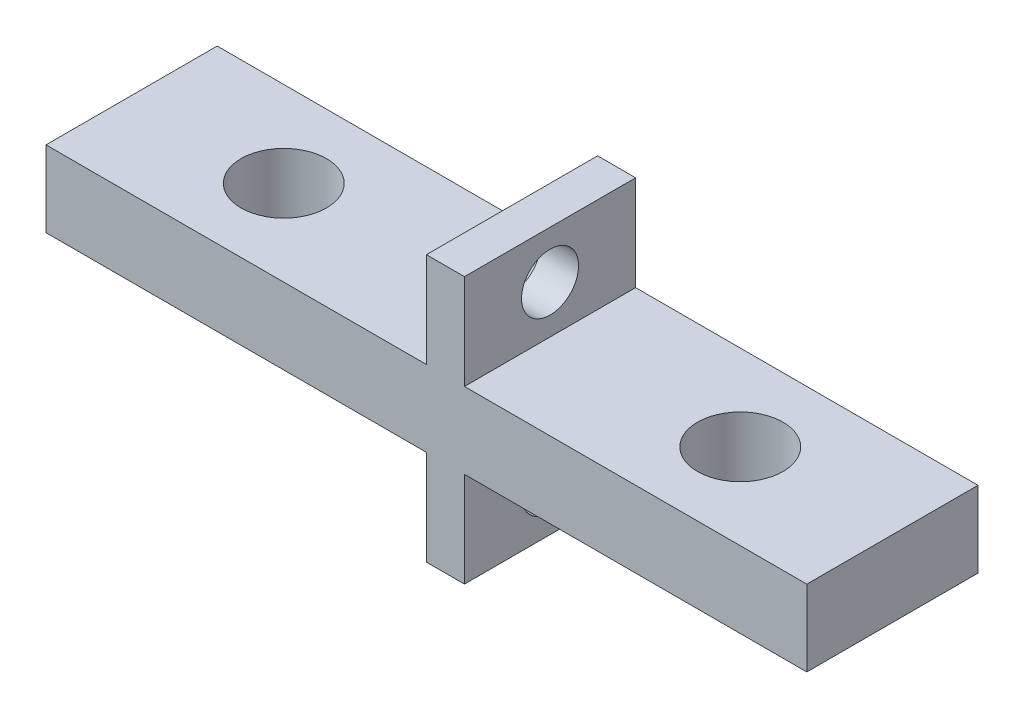
ISO-10303-21;
HEADER;
FILE_DESCRIPTION(('STEP AP214'),'2;1');
FILE_NAME('part.step','',(''),(''),'','','');
FILE_SCHEMA(('AUTOMOTIVE_DESIGN { 1 0 10303 214 1 1 1 1 }'));
ENDSEC;
DATA;
#1=APPLICATION_CONTEXT('core data for automotive mechanical design processes');
#2=APPLICATION_PROTOCOL_DEFINITION('international standard','automotive_design',2000,#1);
#3=PRODUCT_CONTEXT('',#1,'mechanical');
#4=PRODUCT('Part','Part','',(#3));
#5=PRODUCT_RELATED_PRODUCT_CATEGORY('part','',(#4));
#6=PRODUCT_DEFINITION_FORMATION('','',#4);
#7=PRODUCT_DEFINITION_CONTEXT('part definition',#1,'design');
#8=PRODUCT_DEFINITION('design','',#6,#7);
#9=PRODUCT_DEFINITION_SHAPE('','',#8);
#10=(LENGTH_UNIT() NAMED_UNIT(*) SI_UNIT(.MILLI.,.METRE.));
#11=(NAMED_UNIT(*) PLANE_ANGLE_UNIT() SI_UNIT($,.RADIAN.));
#12=(NAMED_UNIT(*) SI_UNIT($,.STERADIAN.) SOLID_ANGLE_UNIT());
#13=UNCERTAINTY_MEASURE_WITH_UNIT(LENGTH_MEASURE(1.E-05),#10,'distance_accuracy_value','');
#14=(GEOMETRIC_REPRESENTATION_CONTEXT(3) GLOBAL_UNCERTAINTY_ASSIGNED_CONTEXT((#13)) GLOBAL_UNIT_ASSIGNED_CONTEXT((#10,
#11,#12)) REPRESENTATION_CONTEXT('',''));
#15=CARTESIAN_POINT('',(0.,0.,0.));
#16=DIRECTION('',(0.,0.,1.));
#17=DIRECTION('',(1.,0.,0.));
#18=AXIS2_PLACEMENT_3D('',#15,#16,#17);
#19=CARTESIAN_POINT('',(0.,4.,0.));
#20=DIRECTION('',(0.,1.,0.));
#21=DIRECTION('',(0.,0.,1.));
#22=AXIS2_PLACEMENT_3D('',#19,#20,#21);
#23=PLANE('',#22);
#24=DIRECTION('',(0.,0.,1.));
#25=VECTOR('',#24,1.);
#26=CARTESIAN_POINT('',(12.7736329978232,4.,0.));
#27=LINE('',#26,#25);
#28=CARTESIAN_POINT('',(12.7736329978232,4.,-5.3135593220339));
#29=VERTEX_POINT('',#28);
#30=CARTESIAN_POINT('',(12.7736329978232,4.,3.6864406779661));
#31=VERTEX_POINT('',#30);
#32=EDGE_CURVE('E47',#29,#31,#27,.T.);
#33=ORIENTED_EDGE('',*,*,#32,.F.);
#34=DIRECTION('',(-1.,0.,0.));
#35=VECTOR('',#34,1.);
#36=CARTESIAN_POINT('',(-7.22636700217678,4.,-5.3135593220339));
#37=LINE('',#36,#35);
#38=CARTESIAN_POINT('',(-7.22636700217678,4.,-5.3135593220339));
#39=VERTEX_POINT('',#38);
#40=EDGE_CURVE('E200',#29,#39,#37,.T.);
#41=ORIENTED_EDGE('',*,*,#40,.T.);
#42=DIRECTION('',(0.,0.,1.));
#43=VECTOR('',#42,1.);
#44=CARTESIAN_POINT('',(-7.22636700217678,4.,-5.3135593220339));
#45=LINE('',#44,#43);
#46=CARTESIAN_POINT('',(-7.22636700217678,4.,3.6864406779661));
#47=VERTEX_POINT('',#46);
#48=EDGE_CURVE('E191',#39,#47,#45,.T.);
#49=ORIENTED_EDGE('',*,*,#48,.T.);
#50=DIRECTION('',(1.,0.,0.));
#51=VECTOR('',#50,1.);
#52=CARTESIAN_POINT('',(-7.22636700217678,4.,3.6864406779661));
#53=LINE('',#52,#51);
#54=EDGE_CURVE('E196',#47,#31,#53,.T.);
#55=ORIENTED_EDGE('',*,*,#54,.T.);
#56=EDGE_LOOP('',(#33,#41,#49,#55));
#57=FACE_BOUND('',#56,.T.);
#58=CARTESIAN_POINT('',(0.773632997823222,4.,-0.8135593220339));
#59=DIRECTION('',(0.,1.,0.));
#60=DIRECTION('',(0.,0.,1.));
#61=AXIS2_PLACEMENT_3D('',#58,#59,#60);
#62=CIRCLE('',#61,2.2479);
#63=CARTESIAN_POINT('',(0.773632997823222,4.,1.4343406779661));
#64=VERTEX_POINT('',#63);
#65=EDGE_CURVE('E180',#64,#64,#62,.T.);
#66=ORIENTED_EDGE('',*,*,#65,.F.);
#67=EDGE_LOOP('',(#66));
#68=FACE_BOUND('',#67,.T.);
#69=ADVANCED_FACE('F32',(#57,#68),#23,.T.);
#70=CARTESIAN_POINT('',(0.,0.,0.));
#71=DIRECTION('',(0.,1.,0.));
#72=DIRECTION('',(0.,0.,1.));
#73=AXIS2_PLACEMENT_3D('',#70,#71,#72);
#74=PLANE('',#73);
#75=CARTESIAN_POINT('',(0.773632997823222,0.,-0.8135593220339));
#76=DIRECTION('',(0.,1.,0.));
#77=DIRECTION('',(0.,0.,1.));
#78=AXIS2_PLACEMENT_3D('',#75,#76,#77);
#79=CIRCLE('',#78,2.2479);
#80=CARTESIAN_POINT('',(0.773632997823222,0.,1.4343406779661));
#81=VERTEX_POINT('',#80);
#82=EDGE_CURVE('E183',#81,#81,#79,.T.);
#83=ORIENTED_EDGE('',*,*,#82,.T.);
#84=EDGE_LOOP('',(#83));
#85=FACE_BOUND('',#84,.T.);
#86=DIRECTION('',(-1.,0.,0.));
#87=VECTOR('',#86,1.);
#88=CARTESIAN_POINT('',(-7.22636700217678,0.,-5.3135593220339));
#89=LINE('',#88,#87);
#90=CARTESIAN_POINT('',(12.7736329978232,0.,-5.3135593220339));
#91=VERTEX_POINT('',#90);
#92=CARTESIAN_POINT('',(-7.22636700217678,0.,-5.3135593220339));
#93=VERTEX_POINT('',#92);
#94=EDGE_CURVE('E211',#91,#93,#89,.T.);
#95=ORIENTED_EDGE('',*,*,#94,.F.);
#96=DIRECTION('',(0.,0.,1.));
#97=VECTOR('',#96,1.);
#98=CARTESIAN_POINT('',(12.7736329978232,0.,0.));
#99=LINE('',#98,#97);
#100=CARTESIAN_POINT('',(12.7736329978232,0.,3.6864406779661));
#101=VERTEX_POINT('',#100);
#102=EDGE_CURVE('E11',#91,#101,#99,.T.);
#103=ORIENTED_EDGE('',*,*,#102,.T.);
#104=DIRECTION('',(1.,0.,0.));
#105=VECTOR('',#104,1.);
#106=CARTESIAN_POINT('',(-7.22636700217678,0.,3.6864406779661));
#107=LINE('',#106,#105);
#108=CARTESIAN_POINT('',(-7.22636700217678,0.,3.6864406779661));
#109=VERTEX_POINT('',#108);
#110=EDGE_CURVE('E206',#109,#101,#107,.T.);
#111=ORIENTED_EDGE('',*,*,#110,.F.);
#112=DIRECTION('',(0.,0.,1.));
#113=VECTOR('',#112,1.);
#114=CARTESIAN_POINT('',(-7.22636700217678,0.,-5.3135593220339));
#115=LINE('',#114,#113);
#116=EDGE_CURVE('E190',#93,#109,#115,.T.);
#117=ORIENTED_EDGE('',*,*,#116,.F.);
#118=EDGE_LOOP('',(#95,#103,#111,#117));
#119=FACE_BOUND('',#118,.T.);
#120=ADVANCED_FACE('F254',(#85,#119),#74,.F.);
#121=CARTESIAN_POINT('',(-7.22636700217678,4.,-5.3135593220339));
#122=DIRECTION('',(1.,0.,0.));
#123=DIRECTION('',(0.,0.,-1.));
#124=AXIS2_PLACEMENT_3D('',#121,#122,#123);
#125=PLANE('',#124);
#126=ORIENTED_EDGE('',*,*,#116,.T.);
#127=DIRECTION('',(0.,-1.,0.));
#128=VECTOR('',#127,1.);
#129=CARTESIAN_POINT('',(-7.22636700217678,4.,3.6864406779661));
#130=LINE('',#129,#128);
#131=EDGE_CURVE('E222',#47,#109,#130,.T.);
#132=ORIENTED_EDGE('',*,*,#131,.F.);
#133=ORIENTED_EDGE('',*,*,#48,.F.);
#134=DIRECTION('',(0.,-1.,0.));
#135=VECTOR('',#134,1.);
#136=CARTESIAN_POINT('',(-7.22636700217678,4.,-5.3135593220339));
#137=LINE('',#136,#135);
#138=EDGE_CURVE('E202',#39,#93,#137,.T.);
#139=ORIENTED_EDGE('',*,*,#138,.T.);
#140=EDGE_LOOP('',(#126,#132,#133,#139));
#141=FACE_BOUND('',#140,.T.);
#142=ADVANCED_FACE('F34',(#141),#125,.F.);
#143=CARTESIAN_POINT('',(-7.22636700217678,4.,3.6864406779661));
#144=DIRECTION('',(0.,0.,-1.));
#145=DIRECTION('',(-1.,0.,0.));
#146=AXIS2_PLACEMENT_3D('',#143,#144,#145);
#147=PLANE('',#146);
#148=CARTESIAN_POINT('',(14.7736329978232,4.,3.6864406779661));
#149=VERTEX_POINT('',#148);
#150=CARTESIAN_POINT('',(32.7736329978232,4.,3.6864406779661));
#151=VERTEX_POINT('',#150);
#152=EDGE_CURVE('E194',#149,#151,#53,.T.);
#153=ORIENTED_EDGE('',*,*,#152,.F.);
#154=DIRECTION('',(0.,1.,0.));
#155=VECTOR('',#154,1.);
#156=CARTESIAN_POINT('',(14.7736329978232,-5.,3.6864406779661));
#157=LINE('',#156,#155);
#158=CARTESIAN_POINT('',(14.7736329978232,8.99999999999997,3.6864406779661));
#159=VERTEX_POINT('',#158);
#160=EDGE_CURVE('E136',#149,#159,#157,.T.);
#161=ORIENTED_EDGE('',*,*,#160,.T.);
#162=DIRECTION('',(1.,0.,0.));
#163=VECTOR('',#162,1.);
#164=CARTESIAN_POINT('',(12.7736329978232,8.99999999999997,3.6864406779661));
#165=LINE('',#164,#163);
#166=CARTESIAN_POINT('',(12.7736329978232,8.99999999999997,3.6864406779661));
#167=VERTEX_POINT('',#166);
#168=EDGE_CURVE('E133',#167,#159,#165,.T.);
#169=ORIENTED_EDGE('',*,*,#168,.F.);
#170=DIRECTION('',(0.,1.,0.));
#171=VECTOR('',#170,1.);
#172=CARTESIAN_POINT('',(12.7736329978232,-5.,3.6864406779661));
#173=LINE('',#172,#171);
#174=EDGE_CURVE('E122',#31,#167,#173,.T.);
#175=ORIENTED_EDGE('',*,*,#174,.F.);
#176=ORIENTED_EDGE('',*,*,#54,.F.);
#177=ORIENTED_EDGE('',*,*,#131,.T.);
#178=ORIENTED_EDGE('',*,*,#110,.T.);
#179=CARTESIAN_POINT('',(12.7736329978232,-5.,3.6864406779661));
#180=VERTEX_POINT('',#179);
#181=EDGE_CURVE('E129',#180,#101,#173,.T.);
#182=ORIENTED_EDGE('',*,*,#181,.F.);
#183=DIRECTION('',(1.,0.,0.));
#184=VECTOR('',#183,1.);
#185=CARTESIAN_POINT('',(12.7736329978232,-5.,3.6864406779661));
#186=LINE('',#185,#184);
#187=CARTESIAN_POINT('',(14.7736329978232,-5.,3.6864406779661));
#188=VERTEX_POINT('',#187);
#189=EDGE_CURVE('E160',#180,#188,#186,.T.);
#190=ORIENTED_EDGE('',*,*,#189,.T.);
#191=CARTESIAN_POINT('',(14.7736329978232,0.,3.6864406779661));
#192=VERTEX_POINT('',#191);
#193=EDGE_CURVE('E176',#188,#192,#157,.T.);
#194=ORIENTED_EDGE('',*,*,#193,.T.);
#195=CARTESIAN_POINT('',(32.7736329978232,0.,3.6864406779661));
#196=VERTEX_POINT('',#195);
#197=EDGE_CURVE('E205',#192,#196,#107,.T.);
#198=ORIENTED_EDGE('',*,*,#197,.T.);
#199=DIRECTION('',(0.,-1.,0.));
#200=VECTOR('',#199,1.);
#201=CARTESIAN_POINT('',(32.7736329978232,4.,3.6864406779661));
#202=LINE('',#201,#200);
#203=EDGE_CURVE('E219',#151,#196,#202,.T.);
#204=ORIENTED_EDGE('',*,*,#203,.F.);
#205=EDGE_LOOP('',(#153,#161,#169,#175,#176,#177,#178,#182,#190,#194,#198,#204));
#206=FACE_BOUND('',#205,.T.);
#207=ADVANCED_FACE('F134',(#206),#147,.F.);
#208=CARTESIAN_POINT('',(32.7736329978232,4.,-5.3135593220339));
#209=DIRECTION('',(-1.,0.,0.));
#210=DIRECTION('',(0.,0.,1.));
#211=AXIS2_PLACEMENT_3D('',#208,#209,#210);
#212=PLANE('',#211);
#213=DIRECTION('',(0.,0.,-1.));
#214=VECTOR('',#213,1.);
#215=CARTESIAN_POINT('',(32.7736329978232,0.,-5.3135593220339));
#216=LINE('',#215,#214);
#217=CARTESIAN_POINT('',(32.7736329978232,0.,-5.3135593220339));
#218=VERTEX_POINT('',#217);
#219=EDGE_CURVE('E209',#196,#218,#216,.T.);
#220=ORIENTED_EDGE('',*,*,#219,.T.);
#221=DIRECTION('',(0.,-1.,0.));
#222=VECTOR('',#221,1.);
#223=CARTESIAN_POINT('',(32.7736329978232,4.,-5.3135593220339));
#224=LINE('',#223,#222);
#225=CARTESIAN_POINT('',(32.7736329978232,4.,-5.3135593220339));
#226=VERTEX_POINT('',#225);
#227=EDGE_CURVE('E216',#226,#218,#224,.T.);
#228=ORIENTED_EDGE('',*,*,#227,.F.);
#229=DIRECTION('',(0.,0.,-1.));
#230=VECTOR('',#229,1.);
#231=CARTESIAN_POINT('',(32.7736329978232,4.,-5.3135593220339));
#232=LINE('',#231,#230);
#233=EDGE_CURVE('E198',#151,#226,#232,.T.);
#234=ORIENTED_EDGE('',*,*,#233,.F.);
#235=ORIENTED_EDGE('',*,*,#203,.T.);
#236=EDGE_LOOP('',(#220,#228,#234,#235));
#237=FACE_BOUND('',#236,.T.);
#238=ADVANCED_FACE('F240',(#237),#212,.F.);
#239=CARTESIAN_POINT('',(-7.22636700217678,4.,-5.3135593220339));
#240=DIRECTION('',(0.,0.,1.));
#241=DIRECTION('',(1.,0.,0.));
#242=AXIS2_PLACEMENT_3D('',#239,#240,#241);
#243=PLANE('',#242);
#244=CARTESIAN_POINT('',(14.7736329978232,0.,-5.3135593220339));
#245=VERTEX_POINT('',#244);
#246=EDGE_CURVE('E195',#218,#245,#89,.T.);
#247=ORIENTED_EDGE('',*,*,#246,.T.);
#248=DIRECTION('',(0.,1.,0.));
#249=VECTOR('',#248,1.);
#250=CARTESIAN_POINT('',(14.7736329978232,-5.,-5.3135593220339));
#251=LINE('',#250,#249);
#252=CARTESIAN_POINT('',(14.7736329978232,-5.,-5.3135593220339));
#253=VERTEX_POINT('',#252);
#254=EDGE_CURVE('E173',#253,#245,#251,.T.);
#255=ORIENTED_EDGE('',*,*,#254,.F.);
#256=DIRECTION('',(-1.,0.,0.));
#257=VECTOR('',#256,1.);
#258=CARTESIAN_POINT('',(12.7736329978232,-5.,-5.3135593220339));
#259=LINE('',#258,#257);
#260=CARTESIAN_POINT('',(12.7736329978232,-5.,-5.3135593220339));
#261=VERTEX_POINT('',#260);
#262=EDGE_CURVE('E130',#253,#261,#259,.T.);
#263=ORIENTED_EDGE('',*,*,#262,.T.);
#264=DIRECTION('',(0.,1.,0.));
#265=VECTOR('',#264,1.);
#266=CARTESIAN_POINT('',(12.7736329978232,-5.,-5.3135593220339));
#267=LINE('',#266,#265);
#268=EDGE_CURVE('E168',#261,#91,#267,.T.);
#269=ORIENTED_EDGE('',*,*,#268,.T.);
#270=ORIENTED_EDGE('',*,*,#94,.T.);
#271=ORIENTED_EDGE('',*,*,#138,.F.);
#272=ORIENTED_EDGE('',*,*,#40,.F.);
#273=CARTESIAN_POINT('',(12.7736329978232,8.99999999999997,-5.3135593220339));
#274=VERTEX_POINT('',#273);
#275=EDGE_CURVE('E172',#29,#274,#267,.T.);
#276=ORIENTED_EDGE('',*,*,#275,.T.);
#277=DIRECTION('',(-1.,0.,0.));
#278=VECTOR('',#277,1.);
#279=CARTESIAN_POINT('',(12.7736329978232,8.99999999999997,-5.3135593220339));
#280=LINE('',#279,#278);
#281=CARTESIAN_POINT('',(14.7736329978232,8.99999999999997,-5.3135593220339));
#282=VERTEX_POINT('',#281);
#283=EDGE_CURVE('E145',#282,#274,#280,.T.);
#284=ORIENTED_EDGE('',*,*,#283,.F.);
#285=CARTESIAN_POINT('',(14.7736329978232,4.,-5.3135593220339));
#286=VERTEX_POINT('',#285);
#287=EDGE_CURVE('E175',#286,#282,#251,.T.);
#288=ORIENTED_EDGE('',*,*,#287,.F.);
#289=EDGE_CURVE('E55',#226,#286,#37,.T.);
#290=ORIENTED_EDGE('',*,*,#289,.F.);
#291=ORIENTED_EDGE('',*,*,#227,.T.);
#292=EDGE_LOOP('',(#247,#255,#263,#269,#270,#271,#272,#276,#284,#288,#290,#291));
#293=FACE_BOUND('',#292,.T.);
#294=ADVANCED_FACE('F235',(#293),#243,.F.);
#295=DIRECTION('',(0.,0.,-1.));
#296=VECTOR('',#295,1.);
#297=CARTESIAN_POINT('',(14.7736329978232,4.,0.));
#298=LINE('',#297,#296);
#299=EDGE_CURVE('E171',#149,#286,#298,.T.);
#300=ORIENTED_EDGE('',*,*,#299,.F.);
#301=ORIENTED_EDGE('',*,*,#152,.T.);
#302=ORIENTED_EDGE('',*,*,#233,.T.);
#303=ORIENTED_EDGE('',*,*,#289,.T.);
#304=EDGE_LOOP('',(#300,#301,#302,#303));
#305=FACE_BOUND('',#304,.T.);
#306=CARTESIAN_POINT('',(24.7736329978232,4.,-0.8135593220339));
#307=DIRECTION('',(0.,1.,0.));
#308=DIRECTION('',(0.,0.,1.));
#309=AXIS2_PLACEMENT_3D('',#306,#307,#308);
#310=CIRCLE('',#309,2.2479);
#311=CARTESIAN_POINT('',(24.7736329978232,4.,1.4343406779661));
#312=VERTEX_POINT('',#311);
#313=EDGE_CURVE('E184',#312,#312,#310,.T.);
#314=ORIENTED_EDGE('',*,*,#313,.F.);
#315=EDGE_LOOP('',(#314));
#316=FACE_BOUND('',#315,.T.);
#317=ADVANCED_FACE('F275',(#305,#316),#23,.T.);
#318=CARTESIAN_POINT('',(24.7736329978232,0.,-0.8135593220339));
#319=DIRECTION('',(0.,1.,0.));
#320=DIRECTION('',(0.,0.,1.));
#321=AXIS2_PLACEMENT_3D('',#318,#319,#320);
#322=CIRCLE('',#321,2.2479);
#323=CARTESIAN_POINT('',(24.7736329978232,0.,1.4343406779661));
#324=VERTEX_POINT('',#323);
#325=EDGE_CURVE('E187',#324,#324,#322,.T.);
#326=ORIENTED_EDGE('',*,*,#325,.T.);
#327=EDGE_LOOP('',(#326));
#328=FACE_BOUND('',#327,.T.);
#329=ORIENTED_EDGE('',*,*,#197,.F.);
#330=DIRECTION('',(0.,0.,-1.));
#331=VECTOR('',#330,1.);
#332=CARTESIAN_POINT('',(14.7736329978232,0.,0.));
#333=LINE('',#332,#331);
#334=EDGE_CURVE('E40',#192,#245,#333,.T.);
#335=ORIENTED_EDGE('',*,*,#334,.T.);
#336=ORIENTED_EDGE('',*,*,#246,.F.);
#337=ORIENTED_EDGE('',*,*,#219,.F.);
#338=EDGE_LOOP('',(#329,#335,#336,#337));
#339=FACE_BOUND('',#338,.T.);
#340=ADVANCED_FACE('F231',(#328,#339),#74,.F.);
#341=CARTESIAN_POINT('',(24.7736329978232,4.,-0.8135593220339));
#342=DIRECTION('',(0.,1.,0.));
#343=DIRECTION('',(0.,0.,1.));
#344=AXIS2_PLACEMENT_3D('',#341,#342,#343);
#345=CYLINDRICAL_SURFACE('',#344,2.2479);
#346=ORIENTED_EDGE('',*,*,#313,.T.);
#347=EDGE_LOOP('',(#346));
#348=FACE_BOUND('',#347,.T.);
#349=ORIENTED_EDGE('',*,*,#325,.F.);
#350=EDGE_LOOP('',(#349));
#351=FACE_BOUND('',#350,.T.);
#352=ADVANCED_FACE('F287',(#348,#351),#345,.F.);
#353=CARTESIAN_POINT('',(0.773632997823222,4.,-0.8135593220339));
#354=DIRECTION('',(0.,1.,0.));
#355=DIRECTION('',(0.,0.,1.));
#356=AXIS2_PLACEMENT_3D('',#353,#354,#355);
#357=CYLINDRICAL_SURFACE('',#356,2.2479);
#358=ORIENTED_EDGE('',*,*,#65,.T.);
#359=EDGE_LOOP('',(#358));
#360=FACE_BOUND('',#359,.T.);
#361=ORIENTED_EDGE('',*,*,#82,.F.);
#362=EDGE_LOOP('',(#361));
#363=FACE_BOUND('',#362,.T.);
#364=ADVANCED_FACE('F295',(#360,#363),#357,.F.);
#365=CARTESIAN_POINT('',(0.,-5.,0.));
#366=DIRECTION('',(0.,-1.,0.));
#367=DIRECTION('',(0.,0.,-1.));
#368=AXIS2_PLACEMENT_3D('',#365,#366,#367);
#369=PLANE('',#368);
#370=DIRECTION('',(0.,0.,1.));
#371=VECTOR('',#370,1.);
#372=CARTESIAN_POINT('',(12.7736329978232,-5.,3.6864406779661));
#373=LINE('',#372,#371);
#374=EDGE_CURVE('E157',#261,#180,#373,.T.);
#375=ORIENTED_EDGE('',*,*,#374,.F.);
#376=ORIENTED_EDGE('',*,*,#262,.F.);
#377=DIRECTION('',(0.,0.,-1.));
#378=VECTOR('',#377,1.);
#379=CARTESIAN_POINT('',(14.7736329978232,-5.,3.6864406779661));
#380=LINE('',#379,#378);
#381=EDGE_CURVE('E163',#188,#253,#380,.T.);
#382=ORIENTED_EDGE('',*,*,#381,.F.);
#383=ORIENTED_EDGE('',*,*,#189,.F.);
#384=EDGE_LOOP('',(#375,#376,#382,#383));
#385=FACE_BOUND('',#384,.T.);
#386=ADVANCED_FACE('F248',(#385),#369,.T.);
#387=CARTESIAN_POINT('',(14.7736329978232,-5.,3.6864406779661));
#388=DIRECTION('',(1.,0.,0.));
#389=DIRECTION('',(0.,0.,-1.));
#390=AXIS2_PLACEMENT_3D('',#387,#388,#389);
#391=PLANE('',#390);
#392=CARTESIAN_POINT('',(14.7736329978232,-2.5,-0.813559322033901));
#393=DIRECTION('',(-1.,0.,0.));
#394=DIRECTION('',(0.,0.,1.));
#395=AXIS2_PLACEMENT_3D('',#392,#393,#394);
#396=CIRCLE('',#395,1.5);
#397=CARTESIAN_POINT('',(14.7736329978232,-2.5,0.686440677966099));
#398=VERTEX_POINT('',#397);
#399=EDGE_CURVE('E327',#398,#398,#396,.T.);
#400=ORIENTED_EDGE('',*,*,#399,.T.);
#401=EDGE_LOOP('',(#400));
#402=FACE_BOUND('',#401,.T.);
#403=ORIENTED_EDGE('',*,*,#334,.F.);
#404=ORIENTED_EDGE('',*,*,#193,.F.);
#405=ORIENTED_EDGE('',*,*,#381,.T.);
#406=ORIENTED_EDGE('',*,*,#254,.T.);
#407=EDGE_LOOP('',(#403,#404,#405,#406));
#408=FACE_BOUND('',#407,.T.);
#409=ADVANCED_FACE('F244',(#402,#408),#391,.T.);
#410=CARTESIAN_POINT('',(12.7736329978232,-5.,3.6864406779661));
#411=DIRECTION('',(-1.,0.,0.));
#412=DIRECTION('',(0.,0.,1.));
#413=AXIS2_PLACEMENT_3D('',#410,#411,#412);
#414=PLANE('',#413);
#415=CARTESIAN_POINT('',(12.7736329978232,-2.5,-0.813559322033901));
#416=DIRECTION('',(-1.,0.,0.));
#417=DIRECTION('',(0.,0.,1.));
#418=AXIS2_PLACEMENT_3D('',#415,#416,#417);
#419=CIRCLE('',#418,1.5);
#420=CARTESIAN_POINT('',(12.7736329978232,-2.5,0.686440677966099));
#421=VERTEX_POINT('',#420);
#422=EDGE_CURVE('E152',#421,#421,#419,.T.);
#423=ORIENTED_EDGE('',*,*,#422,.F.);
#424=EDGE_LOOP('',(#423));
#425=FACE_BOUND('',#424,.T.);
#426=ORIENTED_EDGE('',*,*,#102,.F.);
#427=ORIENTED_EDGE('',*,*,#268,.F.);
#428=ORIENTED_EDGE('',*,*,#374,.T.);
#429=ORIENTED_EDGE('',*,*,#181,.T.);
#430=EDGE_LOOP('',(#426,#427,#428,#429));
#431=FACE_BOUND('',#430,.T.);
#432=ADVANCED_FACE('F259',(#425,#431),#414,.T.);
#433=CARTESIAN_POINT('',(12.7736329978232,6.49999999999997,-0.813559322033901));
#434=DIRECTION('',(-1.,0.,0.));
#435=DIRECTION('',(0.,0.,1.));
#436=AXIS2_PLACEMENT_3D('',#433,#434,#435);
#437=CIRCLE('',#436,1.5);
#438=CARTESIAN_POINT('',(12.7736329978232,6.49999999999997,0.6864406779661));
#439=VERTEX_POINT('',#438);
#440=EDGE_CURVE('E149',#439,#439,#437,.T.);
#441=ORIENTED_EDGE('',*,*,#440,.F.);
#442=EDGE_LOOP('',(#441));
#443=FACE_BOUND('',#442,.T.);
#444=ORIENTED_EDGE('',*,*,#275,.F.);
#445=ORIENTED_EDGE('',*,*,#32,.T.);
#446=ORIENTED_EDGE('',*,*,#174,.T.);
#447=DIRECTION('',(0.,0.,1.));
#448=VECTOR('',#447,1.);
#449=CARTESIAN_POINT('',(12.7736329978232,8.99999999999997,3.6864406779661));
#450=LINE('',#449,#448);
#451=EDGE_CURVE('E127',#274,#167,#450,.T.);
#452=ORIENTED_EDGE('',*,*,#451,.F.);
#453=EDGE_LOOP('',(#444,#445,#446,#452));
#454=FACE_BOUND('',#453,.T.);
#455=ADVANCED_FACE('F125',(#443,#454),#414,.T.);
#456=CARTESIAN_POINT('',(14.7736329978232,6.49999999999997,-0.813559322033901));
#457=DIRECTION('',(-1.,0.,0.));
#458=DIRECTION('',(0.,0.,1.));
#459=AXIS2_PLACEMENT_3D('',#456,#457,#458);
#460=CIRCLE('',#459,1.5);
#461=CARTESIAN_POINT('',(14.7736329978232,6.49999999999997,0.6864406779661));
#462=VERTEX_POINT('',#461);
#463=EDGE_CURVE('E146',#462,#462,#460,.T.);
#464=ORIENTED_EDGE('',*,*,#463,.T.);
#465=EDGE_LOOP('',(#464));
#466=FACE_BOUND('',#465,.T.);
#467=ORIENTED_EDGE('',*,*,#160,.F.);
#468=ORIENTED_EDGE('',*,*,#299,.T.);
#469=ORIENTED_EDGE('',*,*,#287,.T.);
#470=DIRECTION('',(0.,0.,-1.));
#471=VECTOR('',#470,1.);
#472=CARTESIAN_POINT('',(14.7736329978232,8.99999999999997,3.6864406779661));
#473=LINE('',#472,#471);
#474=EDGE_CURVE('E140',#159,#282,#473,.T.);
#475=ORIENTED_EDGE('',*,*,#474,.F.);
#476=EDGE_LOOP('',(#467,#468,#469,#475));
#477=FACE_BOUND('',#476,.T.);
#478=ADVANCED_FACE('F267',(#466,#477),#391,.T.);
#479=CARTESIAN_POINT('',(0.,8.99999999999997,0.));
#480=DIRECTION('',(0.,-1.,0.));
#481=DIRECTION('',(0.,0.,-1.));
#482=AXIS2_PLACEMENT_3D('',#479,#480,#481);
#483=PLANE('',#482);
#484=ORIENTED_EDGE('',*,*,#451,.T.);
#485=ORIENTED_EDGE('',*,*,#168,.T.);
#486=ORIENTED_EDGE('',*,*,#474,.T.);
#487=ORIENTED_EDGE('',*,*,#283,.T.);
#488=EDGE_LOOP('',(#484,#485,#486,#487));
#489=FACE_BOUND('',#488,.T.);
#490=ADVANCED_FACE('F143',(#489),#483,.F.);
#491=CARTESIAN_POINT('',(14.7736329978232,6.49999999999997,-0.813559322033901));
#492=DIRECTION('',(-1.,0.,0.));
#493=DIRECTION('',(0.,0.,1.));
#494=AXIS2_PLACEMENT_3D('',#491,#492,#493);
#495=CYLINDRICAL_SURFACE('',#494,1.5);
#496=ORIENTED_EDGE('',*,*,#463,.F.);
#497=EDGE_LOOP('',(#496));
#498=FACE_BOUND('',#497,.T.);
#499=ORIENTED_EDGE('',*,*,#440,.T.);
#500=EDGE_LOOP('',(#499));
#501=FACE_BOUND('',#500,.T.);
#502=ADVANCED_FACE('F317',(#498,#501),#495,.F.);
#503=CARTESIAN_POINT('',(14.7736329978232,-2.5,-0.813559322033901));
#504=DIRECTION('',(-1.,0.,0.));
#505=DIRECTION('',(0.,0.,1.));
#506=AXIS2_PLACEMENT_3D('',#503,#504,#505);
#507=CYLINDRICAL_SURFACE('',#506,1.5);
#508=ORIENTED_EDGE('',*,*,#399,.F.);
#509=EDGE_LOOP('',(#508));
#510=FACE_BOUND('',#509,.T.);
#511=ORIENTED_EDGE('',*,*,#422,.T.);
#512=EDGE_LOOP('',(#511));
#513=FACE_BOUND('',#512,.T.);
#514=ADVANCED_FACE('F323',(#510,#513),#507,.F.);
#515=CLOSED_SHELL('',(#69,#120,#142,#207,#238,#294,#317,#340,#352,#364,#386,#409,#432,#455,#478,
#490,#502,#514));
#516=MANIFOLD_SOLID_BREP('B2',#515);
#517=ADVANCED_BREP_SHAPE_REPRESENTATION('',(#18,#516),#14);
#518=SHAPE_DEFINITION_REPRESENTATION(#9,#517);
ENDSEC;
END-ISO-10303-21;
